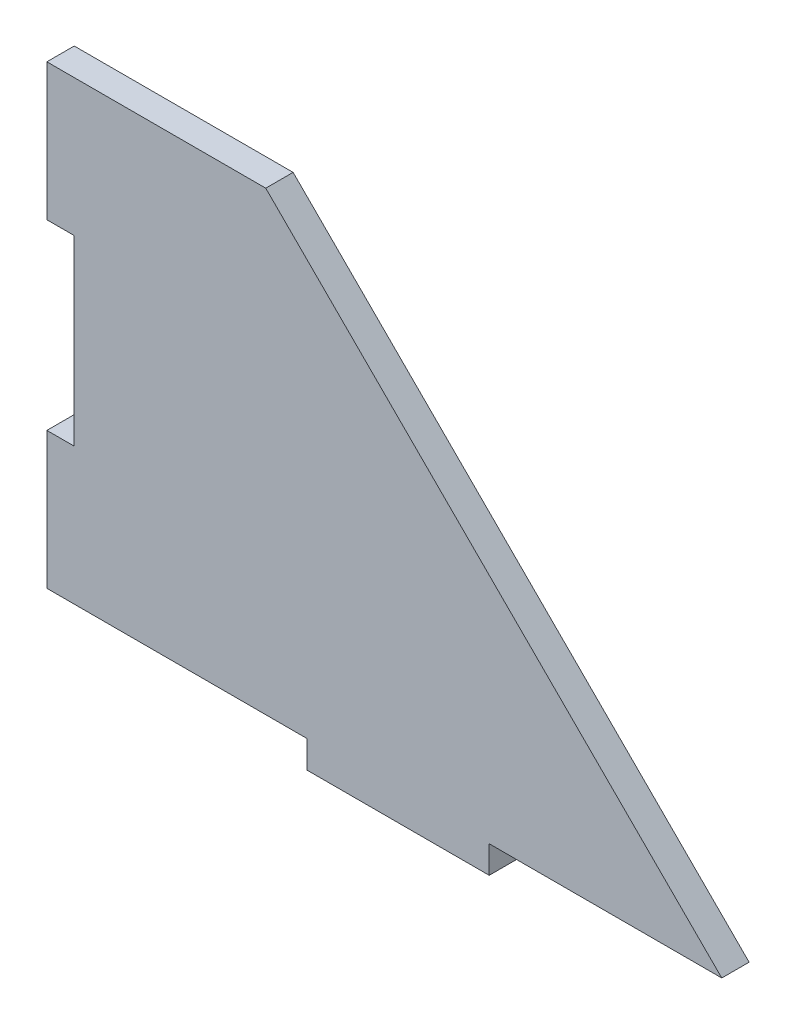
ISO-10303-21;
HEADER;
FILE_DESCRIPTION(('STEP AP214'),'2;1');
FILE_NAME('part.step','',(''),(''),'','','');
FILE_SCHEMA(('AUTOMOTIVE_DESIGN { 1 0 10303 214 1 1 1 1 }'));
ENDSEC;
DATA;
#1=APPLICATION_CONTEXT('core data for automotive mechanical design processes');
#2=APPLICATION_PROTOCOL_DEFINITION('international standard','automotive_design',2000,#1);
#3=PRODUCT_CONTEXT('',#1,'mechanical');
#4=PRODUCT('Part','Part','',(#3));
#5=PRODUCT_RELATED_PRODUCT_CATEGORY('part','',(#4));
#6=PRODUCT_DEFINITION_FORMATION('','',#4);
#7=PRODUCT_DEFINITION_CONTEXT('part definition',#1,'design');
#8=PRODUCT_DEFINITION('design','',#6,#7);
#9=PRODUCT_DEFINITION_SHAPE('','',#8);
#10=(LENGTH_UNIT() NAMED_UNIT(*) SI_UNIT(.MILLI.,.METRE.));
#11=(NAMED_UNIT(*) PLANE_ANGLE_UNIT() SI_UNIT($,.RADIAN.));
#12=(NAMED_UNIT(*) SI_UNIT($,.STERADIAN.) SOLID_ANGLE_UNIT());
#13=UNCERTAINTY_MEASURE_WITH_UNIT(LENGTH_MEASURE(1.E-05),#10,'distance_accuracy_value','');
#14=(GEOMETRIC_REPRESENTATION_CONTEXT(3) GLOBAL_UNCERTAINTY_ASSIGNED_CONTEXT((#13)) GLOBAL_UNIT_ASSIGNED_CONTEXT((#10,
#11,#12)) REPRESENTATION_CONTEXT('',''));
#15=CARTESIAN_POINT('',(0.,0.,0.));
#16=DIRECTION('',(0.,0.,1.));
#17=DIRECTION('',(1.,0.,0.));
#18=AXIS2_PLACEMENT_3D('',#15,#16,#17);
#19=CARTESIAN_POINT('',(-38.5,0.,3.));
#20=DIRECTION('',(1.,0.,0.));
#21=DIRECTION('',(0.,0.,-1.));
#22=AXIS2_PLACEMENT_3D('',#19,#20,#21);
#23=PLANE('',#22);
#24=DIRECTION('',(0.,-1.,0.));
#25=VECTOR('',#24,1.);
#26=CARTESIAN_POINT('',(-38.5,0.,0.));
#27=LINE('',#26,#25);
#28=CARTESIAN_POINT('',(-38.5,25.,0.));
#29=VERTEX_POINT('',#28);
#30=CARTESIAN_POINT('',(-38.5,9.99999999999999,0.));
#31=VERTEX_POINT('',#30);
#32=EDGE_CURVE('E159',#29,#31,#27,.T.);
#33=ORIENTED_EDGE('',*,*,#32,.T.);
#34=DIRECTION('',(0.,0.,1.));
#35=VECTOR('',#34,1.);
#36=CARTESIAN_POINT('',(-38.5,9.99999999999999,0.));
#37=LINE('',#36,#35);
#38=CARTESIAN_POINT('',(-38.5,9.99999999999999,3.));
#39=VERTEX_POINT('',#38);
#40=EDGE_CURVE('E243',#31,#39,#37,.T.);
#41=ORIENTED_EDGE('',*,*,#40,.T.);
#42=DIRECTION('',(0.,-1.,0.));
#43=VECTOR('',#42,1.);
#44=CARTESIAN_POINT('',(-38.5,0.,3.));
#45=LINE('',#44,#43);
#46=CARTESIAN_POINT('',(-38.5,25.,3.));
#47=VERTEX_POINT('',#46);
#48=EDGE_CURVE('E221',#47,#39,#45,.T.);
#49=ORIENTED_EDGE('',*,*,#48,.F.);
#50=DIRECTION('',(0.,0.,-1.));
#51=VECTOR('',#50,1.);
#52=CARTESIAN_POINT('',(-38.5,25.,3.));
#53=LINE('',#52,#51);
#54=EDGE_CURVE('E182',#47,#29,#53,.T.);
#55=ORIENTED_EDGE('',*,*,#54,.T.);
#56=EDGE_LOOP('',(#33,#41,#49,#55));
#57=FACE_BOUND('',#56,.T.);
#58=ADVANCED_FACE('F44',(#57),#23,.F.);
#59=CARTESIAN_POINT('',(0.,-25.,3.));
#60=DIRECTION('',(0.,1.,0.));
#61=DIRECTION('',(0.,0.,1.));
#62=AXIS2_PLACEMENT_3D('',#59,#60,#61);
#63=PLANE('',#62);
#64=DIRECTION('',(0.,0.,1.));
#65=VECTOR('',#64,1.);
#66=CARTESIAN_POINT('',(10.,-25.,0.));
#67=LINE('',#66,#65);
#68=CARTESIAN_POINT('',(10.,-25.,0.));
#69=VERTEX_POINT('',#68);
#70=CARTESIAN_POINT('',(10.,-25.,3.));
#71=VERTEX_POINT('',#70);
#72=EDGE_CURVE('E166',#69,#71,#67,.T.);
#73=ORIENTED_EDGE('',*,*,#72,.F.);
#74=DIRECTION('',(1.,0.,0.));
#75=VECTOR('',#74,1.);
#76=CARTESIAN_POINT('',(0.,-25.,0.));
#77=LINE('',#76,#75);
#78=CARTESIAN_POINT('',(35.5000000000012,-25.,0.));
#79=VERTEX_POINT('',#78);
#80=EDGE_CURVE('E165',#69,#79,#77,.T.);
#81=ORIENTED_EDGE('',*,*,#80,.T.);
#82=DIRECTION('',(0.,0.,-1.));
#83=VECTOR('',#82,1.);
#84=CARTESIAN_POINT('',(35.5000000000012,-25.,3.));
#85=LINE('',#84,#83);
#86=CARTESIAN_POINT('',(35.5000000000012,-25.,3.));
#87=VERTEX_POINT('',#86);
#88=EDGE_CURVE('E53',#87,#79,#85,.T.);
#89=ORIENTED_EDGE('',*,*,#88,.F.);
#90=DIRECTION('',(1.,0.,0.));
#91=VECTOR('',#90,1.);
#92=CARTESIAN_POINT('',(0.,-25.,3.));
#93=LINE('',#92,#91);
#94=EDGE_CURVE('E213',#71,#87,#93,.T.);
#95=ORIENTED_EDGE('',*,*,#94,.F.);
#96=EDGE_LOOP('',(#73,#81,#89,#95));
#97=FACE_BOUND('',#96,.T.);
#98=ADVANCED_FACE('F291',(#97),#63,.F.);
#99=CARTESIAN_POINT('',(-38.5,-10.,3.));
#100=VERTEX_POINT('',#99);
#101=CARTESIAN_POINT('',(-38.5,-25.,3.));
#102=VERTEX_POINT('',#101);
#103=EDGE_CURVE('E150',#100,#102,#45,.T.);
#104=ORIENTED_EDGE('',*,*,#103,.F.);
#105=DIRECTION('',(0.,0.,1.));
#106=VECTOR('',#105,1.);
#107=CARTESIAN_POINT('',(-38.5,-10.,0.));
#108=LINE('',#107,#106);
#109=CARTESIAN_POINT('',(-38.5,-10.,0.));
#110=VERTEX_POINT('',#109);
#111=EDGE_CURVE('E137',#110,#100,#108,.T.);
#112=ORIENTED_EDGE('',*,*,#111,.F.);
#113=CARTESIAN_POINT('',(-38.5,-25.,0.));
#114=VERTEX_POINT('',#113);
#115=EDGE_CURVE('E148',#110,#114,#27,.T.);
#116=ORIENTED_EDGE('',*,*,#115,.T.);
#117=DIRECTION('',(0.,0.,-1.));
#118=VECTOR('',#117,1.);
#119=CARTESIAN_POINT('',(-38.5,-25.,3.));
#120=LINE('',#119,#118);
#121=EDGE_CURVE('E11',#102,#114,#120,.T.);
#122=ORIENTED_EDGE('',*,*,#121,.F.);
#123=EDGE_LOOP('',(#104,#112,#116,#122));
#124=FACE_BOUND('',#123,.T.);
#125=ADVANCED_FACE('F46',(#124),#23,.F.);
#126=CARTESIAN_POINT('',(-9.99999999999999,-25.,0.));
#127=VERTEX_POINT('',#126);
#128=EDGE_CURVE('E157',#114,#127,#77,.T.);
#129=ORIENTED_EDGE('',*,*,#128,.T.);
#130=DIRECTION('',(0.,0.,1.));
#131=VECTOR('',#130,1.);
#132=CARTESIAN_POINT('',(-9.99999999999999,-25.,0.));
#133=LINE('',#132,#131);
#134=CARTESIAN_POINT('',(-9.99999999999999,-25.,3.));
#135=VERTEX_POINT('',#134);
#136=EDGE_CURVE('E160',#127,#135,#133,.T.);
#137=ORIENTED_EDGE('',*,*,#136,.T.);
#138=EDGE_CURVE('E215',#102,#135,#93,.T.);
#139=ORIENTED_EDGE('',*,*,#138,.F.);
#140=ORIENTED_EDGE('',*,*,#121,.T.);
#141=EDGE_LOOP('',(#129,#137,#139,#140));
#142=FACE_BOUND('',#141,.T.);
#143=ADVANCED_FACE('F282',(#142),#63,.F.);
#144=CARTESIAN_POINT('',(5.25000000000018,5.2500000000003,3.));
#145=DIRECTION('',(0.707106781186539,0.707106781186556,0.));
#146=DIRECTION('',(-0.707106781186556,0.707106781186539,0.));
#147=AXIS2_PLACEMENT_3D('',#144,#145,#146);
#148=PLANE('',#147);
#149=DIRECTION('',(0.707106781186556,-0.707106781186539,0.));
#150=VECTOR('',#149,1.);
#151=CARTESIAN_POINT('',(5.25000000000018,5.2500000000003,0.));
#152=LINE('',#151,#150);
#153=CARTESIAN_POINT('',(-14.5,25.,0.));
#154=VERTEX_POINT('',#153);
#155=EDGE_CURVE('E174',#154,#79,#152,.T.);
#156=ORIENTED_EDGE('',*,*,#155,.F.);
#157=DIRECTION('',(0.,0.,-1.));
#158=VECTOR('',#157,1.);
#159=CARTESIAN_POINT('',(-14.5,25.,3.));
#160=LINE('',#159,#158);
#161=CARTESIAN_POINT('',(-14.5,25.,3.));
#162=VERTEX_POINT('',#161);
#163=EDGE_CURVE('E185',#162,#154,#160,.T.);
#164=ORIENTED_EDGE('',*,*,#163,.F.);
#165=DIRECTION('',(0.707106781186556,-0.707106781186539,0.));
#166=VECTOR('',#165,1.);
#167=CARTESIAN_POINT('',(5.25000000000018,5.2500000000003,3.));
#168=LINE('',#167,#166);
#169=EDGE_CURVE('E195',#162,#87,#168,.T.);
#170=ORIENTED_EDGE('',*,*,#169,.T.);
#171=ORIENTED_EDGE('',*,*,#88,.T.);
#172=EDGE_LOOP('',(#156,#164,#170,#171));
#173=FACE_BOUND('',#172,.T.);
#174=ADVANCED_FACE('F193',(#173),#148,.T.);
#175=CARTESIAN_POINT('',(0.,25.,3.));
#176=DIRECTION('',(0.,1.,0.));
#177=DIRECTION('',(0.,0.,1.));
#178=AXIS2_PLACEMENT_3D('',#175,#176,#177);
#179=PLANE('',#178);
#180=DIRECTION('',(1.,0.,0.));
#181=VECTOR('',#180,1.);
#182=CARTESIAN_POINT('',(0.,25.,0.));
#183=LINE('',#182,#181);
#184=EDGE_CURVE('E178',#29,#154,#183,.T.);
#185=ORIENTED_EDGE('',*,*,#184,.F.);
#186=ORIENTED_EDGE('',*,*,#54,.F.);
#187=DIRECTION('',(1.,0.,0.));
#188=VECTOR('',#187,1.);
#189=CARTESIAN_POINT('',(0.,25.,3.));
#190=LINE('',#189,#188);
#191=EDGE_CURVE('E170',#47,#162,#190,.T.);
#192=ORIENTED_EDGE('',*,*,#191,.T.);
#193=ORIENTED_EDGE('',*,*,#163,.T.);
#194=EDGE_LOOP('',(#185,#186,#192,#193));
#195=FACE_BOUND('',#194,.T.);
#196=ADVANCED_FACE('F204',(#195),#179,.T.);
#197=CARTESIAN_POINT('',(0.,0.,3.));
#198=DIRECTION('',(0.,0.,1.));
#199=DIRECTION('',(1.,0.,0.));
#200=AXIS2_PLACEMENT_3D('',#197,#198,#199);
#201=PLANE('',#200);
#202=DIRECTION('',(-1.,0.,0.));
#203=VECTOR('',#202,1.);
#204=CARTESIAN_POINT('',(-38.5,9.99999999999999,3.));
#205=LINE('',#204,#203);
#206=CARTESIAN_POINT('',(-35.5,9.99999999999999,3.));
#207=VERTEX_POINT('',#206);
#208=EDGE_CURVE('E143',#207,#39,#205,.T.);
#209=ORIENTED_EDGE('',*,*,#208,.F.);
#210=DIRECTION('',(0.,1.,0.));
#211=VECTOR('',#210,1.);
#212=CARTESIAN_POINT('',(-35.5,9.99999999999999,3.));
#213=LINE('',#212,#211);
#214=CARTESIAN_POINT('',(-35.5,-10.,3.));
#215=VERTEX_POINT('',#214);
#216=EDGE_CURVE('E263',#215,#207,#213,.T.);
#217=ORIENTED_EDGE('',*,*,#216,.F.);
#218=DIRECTION('',(1.,0.,0.));
#219=VECTOR('',#218,1.);
#220=CARTESIAN_POINT('',(-38.5,-10.,3.));
#221=LINE('',#220,#219);
#222=EDGE_CURVE('E267',#100,#215,#221,.T.);
#223=ORIENTED_EDGE('',*,*,#222,.F.);
#224=ORIENTED_EDGE('',*,*,#103,.T.);
#225=ORIENTED_EDGE('',*,*,#138,.T.);
#226=DIRECTION('',(0.,-1.,0.));
#227=VECTOR('',#226,1.);
#228=CARTESIAN_POINT('',(-9.99999999999999,-25.,3.));
#229=LINE('',#228,#227);
#230=CARTESIAN_POINT('',(-10.,-28.,3.));
#231=VERTEX_POINT('',#230);
#232=EDGE_CURVE('E68',#135,#231,#229,.T.);
#233=ORIENTED_EDGE('',*,*,#232,.T.);
#234=DIRECTION('',(1.,0.,0.));
#235=VECTOR('',#234,1.);
#236=CARTESIAN_POINT('',(-10.,-28.,3.));
#237=LINE('',#236,#235);
#238=CARTESIAN_POINT('',(10.,-28.,3.));
#239=VERTEX_POINT('',#238);
#240=EDGE_CURVE('E237',#231,#239,#237,.T.);
#241=ORIENTED_EDGE('',*,*,#240,.T.);
#242=DIRECTION('',(0.,1.,0.));
#243=VECTOR('',#242,1.);
#244=CARTESIAN_POINT('',(10.,-25.,3.));
#245=LINE('',#244,#243);
#246=EDGE_CURVE('E233',#239,#71,#245,.T.);
#247=ORIENTED_EDGE('',*,*,#246,.T.);
#248=ORIENTED_EDGE('',*,*,#94,.T.);
#249=ORIENTED_EDGE('',*,*,#169,.F.);
#250=ORIENTED_EDGE('',*,*,#191,.F.);
#251=ORIENTED_EDGE('',*,*,#48,.T.);
#252=EDGE_LOOP('',(#209,#217,#223,#224,#225,#233,#241,#247,#248,#249,#250,#251));
#253=FACE_BOUND('',#252,.T.);
#254=ADVANCED_FACE('F210',(#253),#201,.T.);
#255=CARTESIAN_POINT('',(0.,0.,0.));
#256=DIRECTION('',(0.,0.,1.));
#257=DIRECTION('',(1.,0.,0.));
#258=AXIS2_PLACEMENT_3D('',#255,#256,#257);
#259=PLANE('',#258);
#260=DIRECTION('',(0.,1.,0.));
#261=VECTOR('',#260,1.);
#262=CARTESIAN_POINT('',(-35.5,9.99999999999999,0.));
#263=LINE('',#262,#261);
#264=CARTESIAN_POINT('',(-35.5,-10.,0.));
#265=VERTEX_POINT('',#264);
#266=CARTESIAN_POINT('',(-35.5,9.99999999999999,0.));
#267=VERTEX_POINT('',#266);
#268=EDGE_CURVE('E60',#265,#267,#263,.T.);
#269=ORIENTED_EDGE('',*,*,#268,.T.);
#270=DIRECTION('',(-1.,0.,0.));
#271=VECTOR('',#270,1.);
#272=CARTESIAN_POINT('',(-38.5,9.99999999999999,0.));
#273=LINE('',#272,#271);
#274=EDGE_CURVE('E152',#267,#31,#273,.T.);
#275=ORIENTED_EDGE('',*,*,#274,.T.);
#276=ORIENTED_EDGE('',*,*,#32,.F.);
#277=ORIENTED_EDGE('',*,*,#184,.T.);
#278=ORIENTED_EDGE('',*,*,#155,.T.);
#279=ORIENTED_EDGE('',*,*,#80,.F.);
#280=DIRECTION('',(0.,1.,0.));
#281=VECTOR('',#280,1.);
#282=CARTESIAN_POINT('',(10.,-25.,0.));
#283=LINE('',#282,#281);
#284=CARTESIAN_POINT('',(10.,-28.,0.));
#285=VERTEX_POINT('',#284);
#286=EDGE_CURVE('E228',#285,#69,#283,.T.);
#287=ORIENTED_EDGE('',*,*,#286,.F.);
#288=DIRECTION('',(1.,0.,0.));
#289=VECTOR('',#288,1.);
#290=CARTESIAN_POINT('',(-10.,-28.,0.));
#291=LINE('',#290,#289);
#292=CARTESIAN_POINT('',(-10.,-28.,0.));
#293=VERTEX_POINT('',#292);
#294=EDGE_CURVE('E246',#293,#285,#291,.T.);
#295=ORIENTED_EDGE('',*,*,#294,.F.);
#296=DIRECTION('',(0.,-1.,0.));
#297=VECTOR('',#296,1.);
#298=CARTESIAN_POINT('',(-9.99999999999999,-25.,0.));
#299=LINE('',#298,#297);
#300=EDGE_CURVE('E236',#127,#293,#299,.T.);
#301=ORIENTED_EDGE('',*,*,#300,.F.);
#302=ORIENTED_EDGE('',*,*,#128,.F.);
#303=ORIENTED_EDGE('',*,*,#115,.F.);
#304=DIRECTION('',(1.,0.,0.));
#305=VECTOR('',#304,1.);
#306=CARTESIAN_POINT('',(-38.5,-10.,0.));
#307=LINE('',#306,#305);
#308=EDGE_CURVE('E133',#110,#265,#307,.T.);
#309=ORIENTED_EDGE('',*,*,#308,.T.);
#310=EDGE_LOOP('',(#269,#275,#276,#277,#278,#279,#287,#295,#301,#302,#303,#309));
#311=FACE_BOUND('',#310,.T.);
#312=ADVANCED_FACE('F154',(#311),#259,.F.);
#313=CARTESIAN_POINT('',(-9.99999999999999,-25.,0.));
#314=DIRECTION('',(-1.,0.,0.));
#315=DIRECTION('',(0.,-1.,0.));
#316=AXIS2_PLACEMENT_3D('',#313,#314,#315);
#317=PLANE('',#316);
#318=ORIENTED_EDGE('',*,*,#232,.F.);
#319=ORIENTED_EDGE('',*,*,#136,.F.);
#320=ORIENTED_EDGE('',*,*,#300,.T.);
#321=DIRECTION('',(0.,0.,1.));
#322=VECTOR('',#321,1.);
#323=CARTESIAN_POINT('',(-10.,-28.,0.));
#324=LINE('',#323,#322);
#325=EDGE_CURVE('E224',#293,#231,#324,.T.);
#326=ORIENTED_EDGE('',*,*,#325,.T.);
#327=EDGE_LOOP('',(#318,#319,#320,#326));
#328=FACE_BOUND('',#327,.T.);
#329=ADVANCED_FACE('F283',(#328),#317,.T.);
#330=CARTESIAN_POINT('',(10.,-25.,0.));
#331=DIRECTION('',(1.,0.,0.));
#332=DIRECTION('',(0.,0.,-1.));
#333=AXIS2_PLACEMENT_3D('',#330,#331,#332);
#334=PLANE('',#333);
#335=ORIENTED_EDGE('',*,*,#246,.F.);
#336=DIRECTION('',(0.,0.,1.));
#337=VECTOR('',#336,1.);
#338=CARTESIAN_POINT('',(10.,-28.,0.));
#339=LINE('',#338,#337);
#340=EDGE_CURVE('E227',#285,#239,#339,.T.);
#341=ORIENTED_EDGE('',*,*,#340,.F.);
#342=ORIENTED_EDGE('',*,*,#286,.T.);
#343=ORIENTED_EDGE('',*,*,#72,.T.);
#344=EDGE_LOOP('',(#335,#341,#342,#343));
#345=FACE_BOUND('',#344,.T.);
#346=ADVANCED_FACE('F294',(#345),#334,.T.);
#347=CARTESIAN_POINT('',(-10.,-28.,0.));
#348=DIRECTION('',(0.,-1.,0.));
#349=DIRECTION('',(0.,0.,-1.));
#350=AXIS2_PLACEMENT_3D('',#347,#348,#349);
#351=PLANE('',#350);
#352=ORIENTED_EDGE('',*,*,#240,.F.);
#353=ORIENTED_EDGE('',*,*,#325,.F.);
#354=ORIENTED_EDGE('',*,*,#294,.T.);
#355=ORIENTED_EDGE('',*,*,#340,.T.);
#356=EDGE_LOOP('',(#352,#353,#354,#355));
#357=FACE_BOUND('',#356,.T.);
#358=ADVANCED_FACE('F287',(#357),#351,.T.);
#359=CARTESIAN_POINT('',(-38.5,9.99999999999999,0.));
#360=DIRECTION('',(0.,1.,0.));
#361=DIRECTION('',(0.,0.,1.));
#362=AXIS2_PLACEMENT_3D('',#359,#360,#361);
#363=PLANE('',#362);
#364=ORIENTED_EDGE('',*,*,#208,.T.);
#365=ORIENTED_EDGE('',*,*,#40,.F.);
#366=ORIENTED_EDGE('',*,*,#274,.F.);
#367=DIRECTION('',(0.,0.,1.));
#368=VECTOR('',#367,1.);
#369=CARTESIAN_POINT('',(-35.5,9.99999999999999,0.));
#370=LINE('',#369,#368);
#371=EDGE_CURVE('E255',#267,#207,#370,.T.);
#372=ORIENTED_EDGE('',*,*,#371,.T.);
#373=EDGE_LOOP('',(#364,#365,#366,#372));
#374=FACE_BOUND('',#373,.T.);
#375=ADVANCED_FACE('F277',(#374),#363,.F.);
#376=CARTESIAN_POINT('',(-35.5,9.99999999999999,0.));
#377=DIRECTION('',(1.,0.,0.));
#378=DIRECTION('',(0.,0.,-1.));
#379=AXIS2_PLACEMENT_3D('',#376,#377,#378);
#380=PLANE('',#379);
#381=ORIENTED_EDGE('',*,*,#216,.T.);
#382=ORIENTED_EDGE('',*,*,#371,.F.);
#383=ORIENTED_EDGE('',*,*,#268,.F.);
#384=DIRECTION('',(0.,0.,1.));
#385=VECTOR('',#384,1.);
#386=CARTESIAN_POINT('',(-35.5,-10.,0.));
#387=LINE('',#386,#385);
#388=EDGE_CURVE('E139',#265,#215,#387,.T.);
#389=ORIENTED_EDGE('',*,*,#388,.T.);
#390=EDGE_LOOP('',(#381,#382,#383,#389));
#391=FACE_BOUND('',#390,.T.);
#392=ADVANCED_FACE('F278',(#391),#380,.F.);
#393=CARTESIAN_POINT('',(-38.5,-10.,0.));
#394=DIRECTION('',(0.,-1.,0.));
#395=DIRECTION('',(0.,0.,-1.));
#396=AXIS2_PLACEMENT_3D('',#393,#394,#395);
#397=PLANE('',#396);
#398=ORIENTED_EDGE('',*,*,#222,.T.);
#399=ORIENTED_EDGE('',*,*,#388,.F.);
#400=ORIENTED_EDGE('',*,*,#308,.F.);
#401=ORIENTED_EDGE('',*,*,#111,.T.);
#402=EDGE_LOOP('',(#398,#399,#400,#401));
#403=FACE_BOUND('',#402,.T.);
#404=ADVANCED_FACE('F136',(#403),#397,.F.);
#405=CLOSED_SHELL('',(#58,#98,#125,#143,#174,#196,#254,#312,#329,#346,#358,#375,#392,#404));
#406=MANIFOLD_SOLID_BREP('B2',#405);
#407=ADVANCED_BREP_SHAPE_REPRESENTATION('',(#18,#406),#14);
#408=SHAPE_DEFINITION_REPRESENTATION(#9,#407);
ENDSEC;
END-ISO-10303-21;
